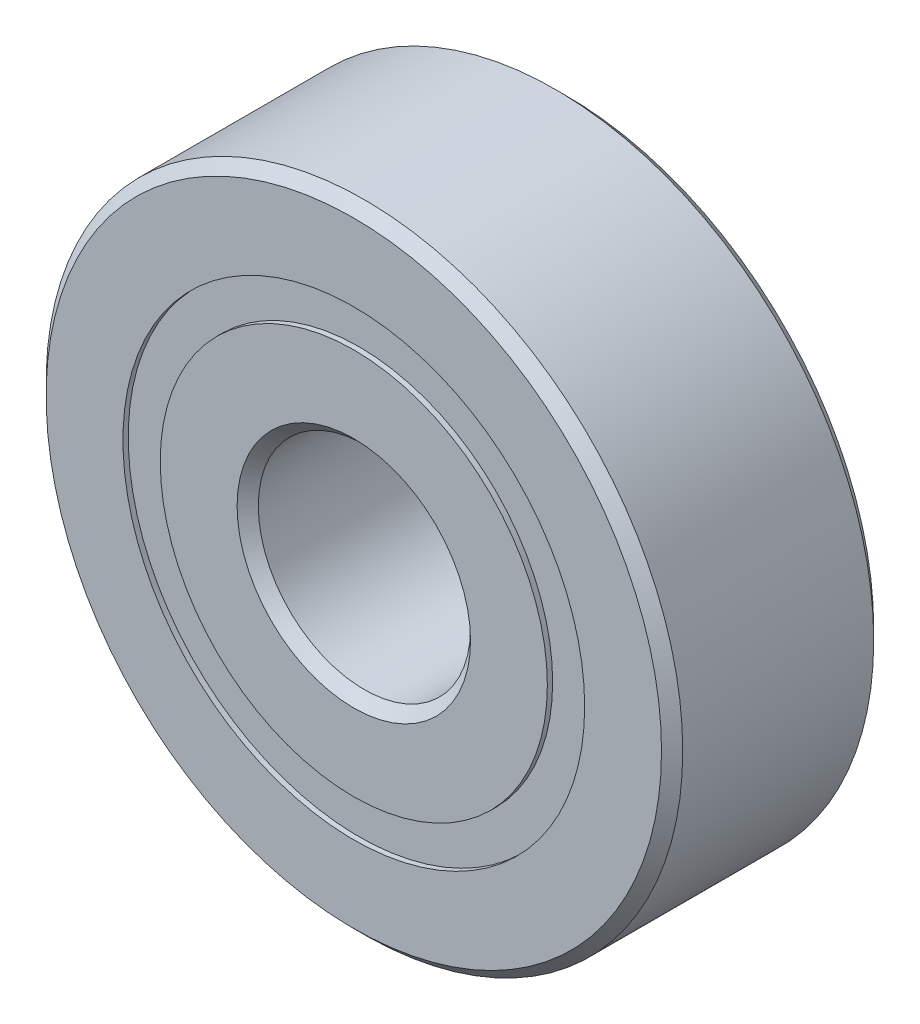
ISO-10303-21;
HEADER;
FILE_DESCRIPTION(('STEP AP214'),'2;1');
FILE_NAME('part.step','',(''),(''),'','','');
FILE_SCHEMA(('AUTOMOTIVE_DESIGN { 1 0 10303 214 1 1 1 1 }'));
ENDSEC;
DATA;
#1=APPLICATION_CONTEXT('core data for automotive mechanical design processes');
#2=APPLICATION_PROTOCOL_DEFINITION('international standard','automotive_design',2000,#1);
#3=PRODUCT_CONTEXT('',#1,'mechanical');
#4=PRODUCT('Part','Part','',(#3));
#5=PRODUCT_RELATED_PRODUCT_CATEGORY('part','',(#4));
#6=PRODUCT_DEFINITION_FORMATION('','',#4);
#7=PRODUCT_DEFINITION_CONTEXT('part definition',#1,'design');
#8=PRODUCT_DEFINITION('design','',#6,#7);
#9=PRODUCT_DEFINITION_SHAPE('','',#8);
#10=(LENGTH_UNIT() NAMED_UNIT(*) SI_UNIT(.MILLI.,.METRE.));
#11=(NAMED_UNIT(*) PLANE_ANGLE_UNIT() SI_UNIT($,.RADIAN.));
#12=(NAMED_UNIT(*) SI_UNIT($,.STERADIAN.) SOLID_ANGLE_UNIT());
#13=UNCERTAINTY_MEASURE_WITH_UNIT(LENGTH_MEASURE(1.E-05),#10,'distance_accuracy_value','');
#14=(GEOMETRIC_REPRESENTATION_CONTEXT(3) GLOBAL_UNCERTAINTY_ASSIGNED_CONTEXT((#13)) GLOBAL_UNIT_ASSIGNED_CONTEXT((#10,
#11,#12)) REPRESENTATION_CONTEXT('',''));
#15=CARTESIAN_POINT('',(0.,0.,0.));
#16=DIRECTION('',(0.,0.,1.));
#17=DIRECTION('',(1.,0.,0.));
#18=AXIS2_PLACEMENT_3D('',#15,#16,#17);
#19=CARTESIAN_POINT('',(0.,4.35164835164835,-1.9));
#20=DIRECTION('',(0.,0.,1.));
#21=DIRECTION('',(1.,0.,0.));
#22=AXIS2_PLACEMENT_3D('',#19,#20,#21);
#23=PLANE('',#22);
#24=CARTESIAN_POINT('',(0.,0.,-1.9));
#25=DIRECTION('',(0.,0.,1.));
#26=DIRECTION('',(1.,0.,0.));
#27=AXIS2_PLACEMENT_3D('',#24,#25,#26);
#28=CIRCLE('',#27,4.35164835164835);
#29=CARTESIAN_POINT('',(4.35164835164835,0.,-1.9));
#30=VERTEX_POINT('',#29);
#31=EDGE_CURVE('E57',#30,#30,#28,.T.);
#32=ORIENTED_EDGE('',*,*,#31,.F.);
#33=EDGE_LOOP('',(#32));
#34=FACE_BOUND('',#33,.T.);
#35=CARTESIAN_POINT('',(0.,0.,-1.9));
#36=DIRECTION('',(0.,0.,1.));
#37=DIRECTION('',(1.,0.,0.));
#38=AXIS2_PLACEMENT_3D('',#35,#36,#37);
#39=CIRCLE('',#38,3.64835164835165);
#40=CARTESIAN_POINT('',(3.64835164835165,0.,-1.9));
#41=VERTEX_POINT('',#40);
#42=EDGE_CURVE('E11',#41,#41,#39,.T.);
#43=ORIENTED_EDGE('',*,*,#42,.T.);
#44=EDGE_LOOP('',(#43));
#45=FACE_BOUND('',#44,.T.);
#46=ADVANCED_FACE('F43',(#34,#45),#23,.F.);
#47=CARTESIAN_POINT('',(0.,0.,2.));
#48=DIRECTION('',(0.,0.,1.));
#49=DIRECTION('',(1.,0.,0.));
#50=AXIS2_PLACEMENT_3D('',#47,#48,#49);
#51=CYLINDRICAL_SURFACE('',#50,3.64835164835165);
#52=ORIENTED_EDGE('',*,*,#42,.F.);
#53=EDGE_LOOP('',(#52));
#54=FACE_BOUND('',#53,.T.);
#55=CARTESIAN_POINT('',(0.,0.,-0.955918417024762));
#56=DIRECTION('',(0.,0.,1.));
#57=DIRECTION('',(1.,0.,0.));
#58=AXIS2_PLACEMENT_3D('',#55,#56,#57);
#59=CIRCLE('',#58,3.64835164835165);
#60=CARTESIAN_POINT('',(3.64835164835165,0.,-0.955918417024762));
#61=VERTEX_POINT('',#60);
#62=EDGE_CURVE('E49',#61,#61,#59,.T.);
#63=ORIENTED_EDGE('',*,*,#62,.T.);
#64=EDGE_LOOP('',(#63));
#65=FACE_BOUND('',#64,.T.);
#66=ADVANCED_FACE('F66',(#54,#65),#51,.F.);
#67=CARTESIAN_POINT('',(0.,4.35164835164835,-0.955918417024762));
#68=DIRECTION('',(0.,0.,-1.));
#69=DIRECTION('',(-1.,0.,0.));
#70=AXIS2_PLACEMENT_3D('',#67,#68,#69);
#71=PLANE('',#70);
#72=ORIENTED_EDGE('',*,*,#62,.F.);
#73=EDGE_LOOP('',(#72));
#74=FACE_BOUND('',#73,.T.);
#75=CARTESIAN_POINT('',(0.,0.,-0.955918417024762));
#76=DIRECTION('',(0.,0.,1.));
#77=DIRECTION('',(1.,0.,0.));
#78=AXIS2_PLACEMENT_3D('',#75,#76,#77);
#79=CIRCLE('',#78,4.35164835164835);
#80=CARTESIAN_POINT('',(4.35164835164835,0.,-0.955918417024762));
#81=VERTEX_POINT('',#80);
#82=EDGE_CURVE('E53',#81,#81,#79,.T.);
#83=ORIENTED_EDGE('',*,*,#82,.T.);
#84=EDGE_LOOP('',(#83));
#85=FACE_BOUND('',#84,.T.);
#86=ADVANCED_FACE('F70',(#74,#85),#71,.F.);
#87=CARTESIAN_POINT('',(0.,0.,2.));
#88=DIRECTION('',(0.,0.,1.));
#89=DIRECTION('',(1.,0.,0.));
#90=AXIS2_PLACEMENT_3D('',#87,#88,#89);
#91=CYLINDRICAL_SURFACE('',#90,4.35164835164835);
#92=ORIENTED_EDGE('',*,*,#82,.F.);
#93=EDGE_LOOP('',(#92));
#94=FACE_BOUND('',#93,.T.);
#95=ORIENTED_EDGE('',*,*,#31,.T.);
#96=EDGE_LOOP('',(#95));
#97=FACE_BOUND('',#96,.T.);
#98=ADVANCED_FACE('F63',(#94,#97),#91,.T.);
#99=CLOSED_SHELL('',(#46,#66,#86,#98));
#100=MANIFOLD_SOLID_BREP('B2',#99);
#101=CARTESIAN_POINT('',(0.,4.35164835164835,1.9));
#102=DIRECTION('',(0.,0.,-1.));
#103=DIRECTION('',(-1.,0.,0.));
#104=AXIS2_PLACEMENT_3D('',#101,#102,#103);
#105=PLANE('',#104);
#106=CARTESIAN_POINT('',(0.,0.,1.9));
#107=DIRECTION('',(0.,0.,1.));
#108=DIRECTION('',(1.,0.,0.));
#109=AXIS2_PLACEMENT_3D('',#106,#107,#108);
#110=CIRCLE('',#109,3.64835164835165);
#111=CARTESIAN_POINT('',(3.64835164835165,0.,1.9));
#112=VERTEX_POINT('',#111);
#113=EDGE_CURVE('E42',#112,#112,#110,.T.);
#114=ORIENTED_EDGE('',*,*,#113,.F.);
#115=EDGE_LOOP('',(#114));
#116=FACE_BOUND('',#115,.T.);
#117=CARTESIAN_POINT('',(0.,0.,1.9));
#118=DIRECTION('',(0.,0.,1.));
#119=DIRECTION('',(1.,0.,0.));
#120=AXIS2_PLACEMENT_3D('',#117,#118,#119);
#121=CIRCLE('',#120,4.35164835164835);
#122=CARTESIAN_POINT('',(4.35164835164835,0.,1.9));
#123=VERTEX_POINT('',#122);
#124=EDGE_CURVE('E124',#123,#123,#121,.T.);
#125=ORIENTED_EDGE('',*,*,#124,.T.);
#126=EDGE_LOOP('',(#125));
#127=FACE_BOUND('',#126,.T.);
#128=ADVANCED_FACE('F110',(#116,#127),#105,.F.);
#129=CARTESIAN_POINT('',(0.,0.,2.));
#130=DIRECTION('',(0.,0.,1.));
#131=DIRECTION('',(1.,0.,0.));
#132=AXIS2_PLACEMENT_3D('',#129,#130,#131);
#133=CYLINDRICAL_SURFACE('',#132,3.64835164835165);
#134=CARTESIAN_POINT('',(0.,0.,0.955918417024761));
#135=DIRECTION('',(0.,0.,1.));
#136=DIRECTION('',(1.,0.,0.));
#137=AXIS2_PLACEMENT_3D('',#134,#135,#136);
#138=CIRCLE('',#137,3.64835164835165);
#139=CARTESIAN_POINT('',(3.64835164835165,0.,0.955918417024761));
#140=VERTEX_POINT('',#139);
#141=EDGE_CURVE('E116',#140,#140,#138,.T.);
#142=ORIENTED_EDGE('',*,*,#141,.F.);
#143=EDGE_LOOP('',(#142));
#144=FACE_BOUND('',#143,.T.);
#145=ORIENTED_EDGE('',*,*,#113,.T.);
#146=EDGE_LOOP('',(#145));
#147=FACE_BOUND('',#146,.T.);
#148=ADVANCED_FACE('F139',(#144,#147),#133,.F.);
#149=CARTESIAN_POINT('',(0.,4.35164835164835,0.955918417024761));
#150=DIRECTION('',(0.,0.,1.));
#151=DIRECTION('',(1.,0.,0.));
#152=AXIS2_PLACEMENT_3D('',#149,#150,#151);
#153=PLANE('',#152);
#154=CARTESIAN_POINT('',(0.,0.,0.955918417024761));
#155=DIRECTION('',(0.,0.,1.));
#156=DIRECTION('',(1.,0.,0.));
#157=AXIS2_PLACEMENT_3D('',#154,#155,#156);
#158=CIRCLE('',#157,4.35164835164835);
#159=CARTESIAN_POINT('',(4.35164835164835,0.,0.955918417024761));
#160=VERTEX_POINT('',#159);
#161=EDGE_CURVE('E120',#160,#160,#158,.T.);
#162=ORIENTED_EDGE('',*,*,#161,.F.);
#163=EDGE_LOOP('',(#162));
#164=FACE_BOUND('',#163,.T.);
#165=ORIENTED_EDGE('',*,*,#141,.T.);
#166=EDGE_LOOP('',(#165));
#167=FACE_BOUND('',#166,.T.);
#168=ADVANCED_FACE('F134',(#164,#167),#153,.F.);
#169=CARTESIAN_POINT('',(0.,0.,2.));
#170=DIRECTION('',(0.,0.,1.));
#171=DIRECTION('',(1.,0.,0.));
#172=AXIS2_PLACEMENT_3D('',#169,#170,#171);
#173=CYLINDRICAL_SURFACE('',#172,4.35164835164835);
#174=ORIENTED_EDGE('',*,*,#124,.F.);
#175=EDGE_LOOP('',(#174));
#176=FACE_BOUND('',#175,.T.);
#177=ORIENTED_EDGE('',*,*,#161,.T.);
#178=EDGE_LOOP('',(#177));
#179=FACE_BOUND('',#178,.T.);
#180=ADVANCED_FACE('F131',(#176,#179),#173,.T.);
#181=CLOSED_SHELL('',(#128,#148,#168,#180));
#182=MANIFOLD_SOLID_BREP('B6',#181);
#183=CARTESIAN_POINT('',(-1.99999999999996,3.46410161513778,0.));
#184=DIRECTION('',(0.,0.,1.));
#185=DIRECTION('',(-0.499999999999989,0.866025403784445,0.));
#186=AXIS2_PLACEMENT_3D('',#183,#184,#185);
#187=SPHERICAL_SURFACE('',#186,0.955918417024761);
#188=CARTESIAN_POINT('',(-1.99999999999996,3.46410161513778,0.955918417024761));
#189=VERTEX_POINT('',#188);
#190=VERTEX_LOOP('',#189);
#191=FACE_BOUND('',#190,.T.);
#192=ADVANCED_FACE('F177',(#191),#187,.T.);
#193=CLOSED_SHELL('',(#192));
#194=MANIFOLD_SOLID_BREP('B37',#193);
#195=CARTESIAN_POINT('',(-3.46410161513773,2.00000000000004,0.));
#196=DIRECTION('',(0.,0.,1.));
#197=DIRECTION('',(-0.866025403784433,0.50000000000001,0.));
#198=AXIS2_PLACEMENT_3D('',#195,#196,#197);
#199=SPHERICAL_SURFACE('',#198,0.955918417024761);
#200=CARTESIAN_POINT('',(-3.46410161513773,2.00000000000004,0.955918417024761));
#201=VERTEX_POINT('',#200);
#202=VERTEX_LOOP('',#201);
#203=FACE_BOUND('',#202,.T.);
#204=ADVANCED_FACE('F198',(#203),#199,.T.);
#205=CLOSED_SHELL('',(#204));
#206=MANIFOLD_SOLID_BREP('B106',#205);
#207=CARTESIAN_POINT('',(-4.,0.,0.));
#208=DIRECTION('',(0.,0.,1.));
#209=DIRECTION('',(-1.,0.,0.));
#210=AXIS2_PLACEMENT_3D('',#207,#208,#209);
#211=SPHERICAL_SURFACE('',#210,0.955918417024761);
#212=CARTESIAN_POINT('',(-4.,0.,0.955918417024761));
#213=VERTEX_POINT('',#212);
#214=VERTEX_LOOP('',#213);
#215=FACE_BOUND('',#214,.T.);
#216=ADVANCED_FACE('F221',(#215),#211,.T.);
#217=CLOSED_SHELL('',(#216));
#218=MANIFOLD_SOLID_BREP('B173',#217);
#219=CARTESIAN_POINT('',(-3.46410161513777,-1.99999999999997,0.));
#220=DIRECTION('',(0.,0.,1.));
#221=DIRECTION('',(-0.866025403784443,-0.499999999999992,0.));
#222=AXIS2_PLACEMENT_3D('',#219,#220,#221);
#223=SPHERICAL_SURFACE('',#222,0.955918417024761);
#224=CARTESIAN_POINT('',(-3.46410161513777,-1.99999999999997,0.955918417024761));
#225=VERTEX_POINT('',#224);
#226=VERTEX_LOOP('',#225);
#227=FACE_BOUND('',#226,.T.);
#228=ADVANCED_FACE('F241',(#227),#223,.T.);
#229=CLOSED_SHELL('',(#228));
#230=MANIFOLD_SOLID_BREP('B194',#229);
#231=CARTESIAN_POINT('',(-2.00000000000003,-3.46410161513774,0.));
#232=DIRECTION('',(0.,0.,1.));
#233=DIRECTION('',(-0.500000000000007,-0.866025403784435,0.));
#234=AXIS2_PLACEMENT_3D('',#231,#232,#233);
#235=SPHERICAL_SURFACE('',#234,0.955918417024761);
#236=CARTESIAN_POINT('',(-2.00000000000003,-3.46410161513774,0.955918417024761));
#237=VERTEX_POINT('',#236);
#238=VERTEX_LOOP('',#237);
#239=FACE_BOUND('',#238,.T.);
#240=ADVANCED_FACE('F261',(#239),#235,.T.);
#241=CLOSED_SHELL('',(#240));
#242=MANIFOLD_SOLID_BREP('B217',#241);
#243=CARTESIAN_POINT('',(0.,-4.,0.));
#244=DIRECTION('',(0.,0.,1.));
#245=DIRECTION('',(0.,-1.,0.));
#246=AXIS2_PLACEMENT_3D('',#243,#244,#245);
#247=SPHERICAL_SURFACE('',#246,0.955918417024761);
#248=CARTESIAN_POINT('',(0.,-4.,0.955918417024761));
#249=VERTEX_POINT('',#248);
#250=VERTEX_LOOP('',#249);
#251=FACE_BOUND('',#250,.T.);
#252=ADVANCED_FACE('F281',(#251),#247,.T.);
#253=CLOSED_SHELL('',(#252));
#254=MANIFOLD_SOLID_BREP('B237',#253);
#255=CARTESIAN_POINT('',(1.99999999999998,-3.46410161513777,0.));
#256=DIRECTION('',(0.,0.,1.));
#257=DIRECTION('',(0.499999999999995,-0.866025403784442,0.));
#258=AXIS2_PLACEMENT_3D('',#255,#256,#257);
#259=SPHERICAL_SURFACE('',#258,0.955918417024761);
#260=CARTESIAN_POINT('',(1.99999999999998,-3.46410161513777,0.955918417024761));
#261=VERTEX_POINT('',#260);
#262=VERTEX_LOOP('',#261);
#263=FACE_BOUND('',#262,.T.);
#264=ADVANCED_FACE('F301',(#263),#259,.T.);
#265=CLOSED_SHELL('',(#264));
#266=MANIFOLD_SOLID_BREP('B257',#265);
#267=CARTESIAN_POINT('',(3.46410161513775,-2.00000000000002,0.));
#268=DIRECTION('',(0.,0.,1.));
#269=DIRECTION('',(0.866025403784436,-0.500000000000004,0.));
#270=AXIS2_PLACEMENT_3D('',#267,#268,#269);
#271=SPHERICAL_SURFACE('',#270,0.955918417024761);
#272=CARTESIAN_POINT('',(3.46410161513775,-2.00000000000002,0.955918417024761));
#273=VERTEX_POINT('',#272);
#274=VERTEX_LOOP('',#273);
#275=FACE_BOUND('',#274,.T.);
#276=ADVANCED_FACE('F321',(#275),#271,.T.);
#277=CLOSED_SHELL('',(#276));
#278=MANIFOLD_SOLID_BREP('B277',#277);
#279=CARTESIAN_POINT('',(4.,0.,0.));
#280=DIRECTION('',(0.,0.,1.));
#281=DIRECTION('',(1.,0.,0.));
#282=AXIS2_PLACEMENT_3D('',#279,#280,#281);
#283=SPHERICAL_SURFACE('',#282,0.955918417024761);
#284=CARTESIAN_POINT('',(4.,0.,0.955918417024761));
#285=VERTEX_POINT('',#284);
#286=VERTEX_LOOP('',#285);
#287=FACE_BOUND('',#286,.T.);
#288=ADVANCED_FACE('F341',(#287),#283,.T.);
#289=CLOSED_SHELL('',(#288));
#290=MANIFOLD_SOLID_BREP('B297',#289);
#291=CARTESIAN_POINT('',(3.46410161513776,1.99999999999999,0.));
#292=DIRECTION('',(0.,0.,1.));
#293=DIRECTION('',(0.86602540378444,0.499999999999998,0.));
#294=AXIS2_PLACEMENT_3D('',#291,#292,#293);
#295=SPHERICAL_SURFACE('',#294,0.955918417024761);
#296=CARTESIAN_POINT('',(3.46410161513776,1.99999999999999,0.955918417024761));
#297=VERTEX_POINT('',#296);
#298=VERTEX_LOOP('',#297);
#299=FACE_BOUND('',#298,.T.);
#300=ADVANCED_FACE('F361',(#299),#295,.T.);
#301=CLOSED_SHELL('',(#300));
#302=MANIFOLD_SOLID_BREP('B317',#301);
#303=CARTESIAN_POINT('',(2.,3.46410161513775,0.));
#304=DIRECTION('',(0.,0.,1.));
#305=DIRECTION('',(0.500000000000001,0.866025403784438,0.));
#306=AXIS2_PLACEMENT_3D('',#303,#304,#305);
#307=SPHERICAL_SURFACE('',#306,0.955918417024761);
#308=CARTESIAN_POINT('',(2.,3.46410161513775,0.955918417024761));
#309=VERTEX_POINT('',#308);
#310=VERTEX_LOOP('',#309);
#311=FACE_BOUND('',#310,.T.);
#312=ADVANCED_FACE('F382',(#311),#307,.T.);
#313=CLOSED_SHELL('',(#312));
#314=MANIFOLD_SOLID_BREP('B337',#313);
#315=CARTESIAN_POINT('',(0.,4.,0.));
#316=DIRECTION('',(0.,0.,1.));
#317=DIRECTION('',(0.,1.,0.));
#318=AXIS2_PLACEMENT_3D('',#315,#316,#317);
#319=SPHERICAL_SURFACE('',#318,0.955918417024761);
#320=CARTESIAN_POINT('',(0.,4.,0.955918417024761));
#321=VERTEX_POINT('',#320);
#322=VERTEX_LOOP('',#321);
#323=FACE_BOUND('',#322,.T.);
#324=ADVANCED_FACE('F408',(#323),#319,.T.);
#325=CLOSED_SHELL('',(#324));
#326=MANIFOLD_SOLID_BREP('B357',#325);
#327=CARTESIAN_POINT('',(0.,3.64835164835165,2.));
#328=DIRECTION('',(0.,0.,-1.));
#329=DIRECTION('',(-1.,0.,0.));
#330=AXIS2_PLACEMENT_3D('',#327,#328,#329);
#331=PLANE('',#330);
#332=CARTESIAN_POINT('',(0.,0.,2.));
#333=DIRECTION('',(0.,0.,1.));
#334=DIRECTION('',(1.,0.,0.));
#335=AXIS2_PLACEMENT_3D('',#332,#333,#334);
#336=CIRCLE('',#335,2.2);
#337=CARTESIAN_POINT('',(2.2,0.,2.));
#338=VERTEX_POINT('',#337);
#339=EDGE_CURVE('E459',#338,#338,#336,.T.);
#340=ORIENTED_EDGE('',*,*,#339,.F.);
#341=EDGE_LOOP('',(#340));
#342=FACE_BOUND('',#341,.T.);
#343=CARTESIAN_POINT('',(0.,0.,2.));
#344=DIRECTION('',(0.,0.,1.));
#345=DIRECTION('',(1.,0.,0.));
#346=AXIS2_PLACEMENT_3D('',#343,#344,#345);
#347=CIRCLE('',#346,3.64835164835165);
#348=CARTESIAN_POINT('',(3.64835164835165,0.,2.));
#349=VERTEX_POINT('',#348);
#350=EDGE_CURVE('E407',#349,#349,#347,.T.);
#351=ORIENTED_EDGE('',*,*,#350,.T.);
#352=EDGE_LOOP('',(#351));
#353=FACE_BOUND('',#352,.T.);
#354=ADVANCED_FACE('F431',(#342,#353),#331,.F.);
#355=CARTESIAN_POINT('',(0.,0.,2.));
#356=DIRECTION('',(0.,0.,1.));
#357=DIRECTION('',(1.,0.,0.));
#358=AXIS2_PLACEMENT_3D('',#355,#356,#357);
#359=CYLINDRICAL_SURFACE('',#358,3.64835164835165);
#360=ORIENTED_EDGE('',*,*,#350,.F.);
#361=EDGE_LOOP('',(#360));
#362=FACE_BOUND('',#361,.T.);
#363=CARTESIAN_POINT('',(0.,0.,0.888888888888889));
#364=DIRECTION('',(0.,0.,1.));
#365=DIRECTION('',(1.,0.,0.));
#366=AXIS2_PLACEMENT_3D('',#363,#364,#365);
#367=CIRCLE('',#366,3.64835164835165);
#368=CARTESIAN_POINT('',(3.64835164835165,0.,0.888888888888889));
#369=VERTEX_POINT('',#368);
#370=EDGE_CURVE('E437',#369,#369,#367,.T.);
#371=ORIENTED_EDGE('',*,*,#370,.T.);
#372=EDGE_LOOP('',(#371));
#373=FACE_BOUND('',#372,.T.);
#374=ADVANCED_FACE('F466',(#362,#373),#359,.T.);
#375=CARTESIAN_POINT('',(0.,0.,0.));
#376=DIRECTION('',(0.,0.,1.));
#377=DIRECTION('',(1.,0.,0.));
#378=AXIS2_PLACEMENT_3D('',#375,#376,#377);
#379=TOROIDAL_SURFACE('',#378,4.,0.95591841702476);
#380=ORIENTED_EDGE('',*,*,#370,.F.);
#381=EDGE_LOOP('',(#380));
#382=FACE_BOUND('',#381,.T.);
#383=CARTESIAN_POINT('',(0.,0.,-0.88888888888889));
#384=DIRECTION('',(0.,0.,1.));
#385=DIRECTION('',(1.,0.,0.));
#386=AXIS2_PLACEMENT_3D('',#383,#384,#385);
#387=CIRCLE('',#386,3.64835164835165);
#388=CARTESIAN_POINT('',(3.64835164835165,0.,-0.88888888888889));
#389=VERTEX_POINT('',#388);
#390=EDGE_CURVE('E441',#389,#389,#387,.T.);
#391=ORIENTED_EDGE('',*,*,#390,.T.);
#392=EDGE_LOOP('',(#391));
#393=FACE_BOUND('',#392,.T.);
#394=ADVANCED_FACE('F470',(#382,#393),#379,.F.);
#395=CARTESIAN_POINT('',(0.,0.,2.));
#396=DIRECTION('',(0.,0.,1.));
#397=DIRECTION('',(1.,0.,0.));
#398=AXIS2_PLACEMENT_3D('',#395,#396,#397);
#399=CYLINDRICAL_SURFACE('',#398,3.64835164835165);
#400=ORIENTED_EDGE('',*,*,#390,.F.);
#401=EDGE_LOOP('',(#400));
#402=FACE_BOUND('',#401,.T.);
#403=CARTESIAN_POINT('',(0.,0.,-2.));
#404=DIRECTION('',(0.,0.,1.));
#405=DIRECTION('',(1.,0.,0.));
#406=AXIS2_PLACEMENT_3D('',#403,#404,#405);
#407=CIRCLE('',#406,3.64835164835165);
#408=CARTESIAN_POINT('',(3.64835164835165,0.,-2.));
#409=VERTEX_POINT('',#408);
#410=EDGE_CURVE('E445',#409,#409,#407,.T.);
#411=ORIENTED_EDGE('',*,*,#410,.T.);
#412=EDGE_LOOP('',(#411));
#413=FACE_BOUND('',#412,.T.);
#414=ADVANCED_FACE('F475',(#402,#413),#399,.T.);
#415=CARTESIAN_POINT('',(0.,2.2,-2.));
#416=DIRECTION('',(0.,0.,1.));
#417=DIRECTION('',(1.,0.,0.));
#418=AXIS2_PLACEMENT_3D('',#415,#416,#417);
#419=PLANE('',#418);
#420=ORIENTED_EDGE('',*,*,#410,.F.);
#421=EDGE_LOOP('',(#420));
#422=FACE_BOUND('',#421,.T.);
#423=CARTESIAN_POINT('',(0.,0.,-2.));
#424=DIRECTION('',(0.,0.,1.));
#425=DIRECTION('',(1.,0.,0.));
#426=AXIS2_PLACEMENT_3D('',#423,#424,#425);
#427=CIRCLE('',#426,2.2);
#428=CARTESIAN_POINT('',(2.2,0.,-2.));
#429=VERTEX_POINT('',#428);
#430=EDGE_CURVE('E450',#429,#429,#427,.T.);
#431=ORIENTED_EDGE('',*,*,#430,.T.);
#432=EDGE_LOOP('',(#431));
#433=FACE_BOUND('',#432,.T.);
#434=ADVANCED_FACE('F481',(#422,#433),#419,.F.);
#435=CARTESIAN_POINT('',(0.,0.,-1.8));
#436=DIRECTION('',(0.,0.,-1.));
#437=DIRECTION('',(-1.,0.,0.));
#438=AXIS2_PLACEMENT_3D('',#435,#436,#437);
#439=CONICAL_SURFACE('',#438,2.,0.785398163397454);
#440=ORIENTED_EDGE('',*,*,#430,.F.);
#441=EDGE_LOOP('',(#440));
#442=FACE_BOUND('',#441,.T.);
#443=CARTESIAN_POINT('',(0.,0.,-1.8));
#444=DIRECTION('',(0.,0.,1.));
#445=DIRECTION('',(1.,0.,0.));
#446=AXIS2_PLACEMENT_3D('',#443,#444,#445);
#447=CIRCLE('',#446,2.);
#448=CARTESIAN_POINT('',(2.,0.,-1.8));
#449=VERTEX_POINT('',#448);
#450=EDGE_CURVE('E453',#449,#449,#447,.T.);
#451=ORIENTED_EDGE('',*,*,#450,.T.);
#452=EDGE_LOOP('',(#451));
#453=FACE_BOUND('',#452,.T.);
#454=ADVANCED_FACE('F485',(#442,#453),#439,.F.);
#455=CARTESIAN_POINT('',(0.,0.,2.));
#456=DIRECTION('',(0.,0.,1.));
#457=DIRECTION('',(1.,0.,0.));
#458=AXIS2_PLACEMENT_3D('',#455,#456,#457);
#459=CYLINDRICAL_SURFACE('',#458,2.);
#460=ORIENTED_EDGE('',*,*,#450,.F.);
#461=EDGE_LOOP('',(#460));
#462=FACE_BOUND('',#461,.T.);
#463=CARTESIAN_POINT('',(0.,0.,1.8));
#464=DIRECTION('',(0.,0.,1.));
#465=DIRECTION('',(1.,0.,0.));
#466=AXIS2_PLACEMENT_3D('',#463,#464,#465);
#467=CIRCLE('',#466,2.);
#468=CARTESIAN_POINT('',(2.,0.,1.8));
#469=VERTEX_POINT('',#468);
#470=EDGE_CURVE('E456',#469,#469,#467,.T.);
#471=ORIENTED_EDGE('',*,*,#470,.T.);
#472=EDGE_LOOP('',(#471));
#473=FACE_BOUND('',#472,.T.);
#474=ADVANCED_FACE('F489',(#462,#473),#459,.F.);
#475=CARTESIAN_POINT('',(0.,0.,2.));
#476=DIRECTION('',(0.,0.,1.));
#477=DIRECTION('',(1.,0.,0.));
#478=AXIS2_PLACEMENT_3D('',#475,#476,#477);
#479=CONICAL_SURFACE('',#478,2.2,0.785398163397442);
#480=ORIENTED_EDGE('',*,*,#470,.F.);
#481=EDGE_LOOP('',(#480));
#482=FACE_BOUND('',#481,.T.);
#483=ORIENTED_EDGE('',*,*,#339,.T.);
#484=EDGE_LOOP('',(#483));
#485=FACE_BOUND('',#484,.T.);
#486=ADVANCED_FACE('F463',(#482,#485),#479,.F.);
#487=CLOSED_SHELL('',(#354,#374,#394,#414,#434,#454,#474,#486));
#488=MANIFOLD_SOLID_BREP('B378',#487);
#489=CARTESIAN_POINT('',(0.,0.,1.8));
#490=DIRECTION('',(0.,0.,-1.));
#491=DIRECTION('',(-1.,0.,0.));
#492=AXIS2_PLACEMENT_3D('',#489,#490,#491);
#493=CONICAL_SURFACE('',#492,6.,0.78539816339745);
#494=CARTESIAN_POINT('',(0.,0.,2.));
#495=DIRECTION('',(0.,0.,1.));
#496=DIRECTION('',(1.,0.,0.));
#497=AXIS2_PLACEMENT_3D('',#494,#495,#496);
#498=CIRCLE('',#497,5.8);
#499=CARTESIAN_POINT('',(5.8,0.,2.));
#500=VERTEX_POINT('',#499);
#501=EDGE_CURVE('E583',#500,#500,#498,.T.);
#502=ORIENTED_EDGE('',*,*,#501,.F.);
#503=EDGE_LOOP('',(#502));
#504=FACE_BOUND('',#503,.T.);
#505=CARTESIAN_POINT('',(0.,0.,1.8));
#506=DIRECTION('',(0.,0.,1.));
#507=DIRECTION('',(1.,0.,0.));
#508=AXIS2_PLACEMENT_3D('',#505,#506,#507);
#509=CIRCLE('',#508,6.);
#510=CARTESIAN_POINT('',(6.,0.,1.8));
#511=VERTEX_POINT('',#510);
#512=EDGE_CURVE('E430',#511,#511,#509,.T.);
#513=ORIENTED_EDGE('',*,*,#512,.T.);
#514=EDGE_LOOP('',(#513));
#515=FACE_BOUND('',#514,.T.);
#516=ADVANCED_FACE('F555',(#504,#515),#493,.T.);
#517=CARTESIAN_POINT('',(0.,0.,2.));
#518=DIRECTION('',(0.,0.,1.));
#519=DIRECTION('',(1.,0.,0.));
#520=AXIS2_PLACEMENT_3D('',#517,#518,#519);
#521=CYLINDRICAL_SURFACE('',#520,6.);
#522=ORIENTED_EDGE('',*,*,#512,.F.);
#523=EDGE_LOOP('',(#522));
#524=FACE_BOUND('',#523,.T.);
#525=CARTESIAN_POINT('',(0.,0.,-1.8));
#526=DIRECTION('',(0.,0.,1.));
#527=DIRECTION('',(1.,0.,0.));
#528=AXIS2_PLACEMENT_3D('',#525,#526,#527);
#529=CIRCLE('',#528,6.);
#530=CARTESIAN_POINT('',(6.,0.,-1.8));
#531=VERTEX_POINT('',#530);
#532=EDGE_CURVE('E561',#531,#531,#529,.T.);
#533=ORIENTED_EDGE('',*,*,#532,.T.);
#534=EDGE_LOOP('',(#533));
#535=FACE_BOUND('',#534,.T.);
#536=ADVANCED_FACE('F590',(#524,#535),#521,.T.);
#537=CARTESIAN_POINT('',(0.,0.,-2.));
#538=DIRECTION('',(0.,0.,1.));
#539=DIRECTION('',(1.,0.,0.));
#540=AXIS2_PLACEMENT_3D('',#537,#538,#539);
#541=CONICAL_SURFACE('',#540,5.8,0.78539816339745);
#542=ORIENTED_EDGE('',*,*,#532,.F.);
#543=EDGE_LOOP('',(#542));
#544=FACE_BOUND('',#543,.T.);
#545=CARTESIAN_POINT('',(0.,0.,-2.));
#546=DIRECTION('',(0.,0.,1.));
#547=DIRECTION('',(1.,0.,0.));
#548=AXIS2_PLACEMENT_3D('',#545,#546,#547);
#549=CIRCLE('',#548,5.8);
#550=CARTESIAN_POINT('',(5.8,0.,-2.));
#551=VERTEX_POINT('',#550);
#552=EDGE_CURVE('E565',#551,#551,#549,.T.);
#553=ORIENTED_EDGE('',*,*,#552,.T.);
#554=EDGE_LOOP('',(#553));
#555=FACE_BOUND('',#554,.T.);
#556=ADVANCED_FACE('F594',(#544,#555),#541,.T.);
#557=CARTESIAN_POINT('',(0.,5.8,-2.));
#558=DIRECTION('',(0.,0.,1.));
#559=DIRECTION('',(1.,0.,0.));
#560=AXIS2_PLACEMENT_3D('',#557,#558,#559);
#561=PLANE('',#560);
#562=ORIENTED_EDGE('',*,*,#552,.F.);
#563=EDGE_LOOP('',(#562));
#564=FACE_BOUND('',#563,.T.);
#565=CARTESIAN_POINT('',(0.,0.,-2.));
#566=DIRECTION('',(0.,0.,1.));
#567=DIRECTION('',(1.,0.,0.));
#568=AXIS2_PLACEMENT_3D('',#565,#566,#567);
#569=CIRCLE('',#568,4.35164835164835);
#570=CARTESIAN_POINT('',(4.35164835164835,0.,-2.));
#571=VERTEX_POINT('',#570);
#572=EDGE_CURVE('E569',#571,#571,#569,.T.);
#573=ORIENTED_EDGE('',*,*,#572,.T.);
#574=EDGE_LOOP('',(#573));
#575=FACE_BOUND('',#574,.T.);
#576=ADVANCED_FACE('F599',(#564,#575),#561,.F.);
#577=CARTESIAN_POINT('',(0.,0.,2.));
#578=DIRECTION('',(0.,0.,1.));
#579=DIRECTION('',(1.,0.,0.));
#580=AXIS2_PLACEMENT_3D('',#577,#578,#579);
#581=CYLINDRICAL_SURFACE('',#580,4.35164835164835);
#582=ORIENTED_EDGE('',*,*,#572,.F.);
#583=EDGE_LOOP('',(#582));
#584=FACE_BOUND('',#583,.T.);
#585=CARTESIAN_POINT('',(0.,0.,-0.888888888888889));
#586=DIRECTION('',(0.,0.,1.));
#587=DIRECTION('',(1.,0.,0.));
#588=AXIS2_PLACEMENT_3D('',#585,#586,#587);
#589=CIRCLE('',#588,4.35164835164835);
#590=CARTESIAN_POINT('',(4.35164835164835,0.,-0.888888888888889));
#591=VERTEX_POINT('',#590);
#592=EDGE_CURVE('E574',#591,#591,#589,.T.);
#593=ORIENTED_EDGE('',*,*,#592,.T.);
#594=EDGE_LOOP('',(#593));
#595=FACE_BOUND('',#594,.T.);
#596=ADVANCED_FACE('F605',(#584,#595),#581,.F.);
#597=CARTESIAN_POINT('',(0.,0.,0.));
#598=DIRECTION('',(0.,0.,1.));
#599=DIRECTION('',(1.,0.,0.));
#600=AXIS2_PLACEMENT_3D('',#597,#598,#599);
#601=TOROIDAL_SURFACE('',#600,4.,0.955918417024761);
#602=ORIENTED_EDGE('',*,*,#592,.F.);
#603=EDGE_LOOP('',(#602));
#604=FACE_BOUND('',#603,.T.);
#605=CARTESIAN_POINT('',(0.,0.,0.888888888888889));
#606=DIRECTION('',(0.,0.,1.));
#607=DIRECTION('',(1.,0.,0.));
#608=AXIS2_PLACEMENT_3D('',#605,#606,#607);
#609=CIRCLE('',#608,4.35164835164835);
#610=CARTESIAN_POINT('',(4.35164835164835,0.,0.888888888888889));
#611=VERTEX_POINT('',#610);
#612=EDGE_CURVE('E577',#611,#611,#609,.T.);
#613=ORIENTED_EDGE('',*,*,#612,.T.);
#614=EDGE_LOOP('',(#613));
#615=FACE_BOUND('',#614,.T.);
#616=ADVANCED_FACE('F609',(#604,#615),#601,.F.);
#617=CARTESIAN_POINT('',(0.,0.,2.));
#618=DIRECTION('',(0.,0.,1.));
#619=DIRECTION('',(1.,0.,0.));
#620=AXIS2_PLACEMENT_3D('',#617,#618,#619);
#621=CYLINDRICAL_SURFACE('',#620,4.35164835164835);
#622=ORIENTED_EDGE('',*,*,#612,.F.);
#623=EDGE_LOOP('',(#622));
#624=FACE_BOUND('',#623,.T.);
#625=CARTESIAN_POINT('',(0.,0.,2.));
#626=DIRECTION('',(0.,0.,1.));
#627=DIRECTION('',(1.,0.,0.));
#628=AXIS2_PLACEMENT_3D('',#625,#626,#627);
#629=CIRCLE('',#628,4.35164835164835);
#630=CARTESIAN_POINT('',(4.35164835164835,0.,2.));
#631=VERTEX_POINT('',#630);
#632=EDGE_CURVE('E580',#631,#631,#629,.T.);
#633=ORIENTED_EDGE('',*,*,#632,.T.);
#634=EDGE_LOOP('',(#633));
#635=FACE_BOUND('',#634,.T.);
#636=ADVANCED_FACE('F613',(#624,#635),#621,.F.);
#637=CARTESIAN_POINT('',(0.,5.8,2.));
#638=DIRECTION('',(0.,0.,-1.));
#639=DIRECTION('',(-1.,0.,0.));
#640=AXIS2_PLACEMENT_3D('',#637,#638,#639);
#641=PLANE('',#640);
#642=ORIENTED_EDGE('',*,*,#632,.F.);
#643=EDGE_LOOP('',(#642));
#644=FACE_BOUND('',#643,.T.);
#645=ORIENTED_EDGE('',*,*,#501,.T.);
#646=EDGE_LOOP('',(#645));
#647=FACE_BOUND('',#646,.T.);
#648=ADVANCED_FACE('F587',(#644,#647),#641,.F.);
#649=CLOSED_SHELL('',(#516,#536,#556,#576,#596,#616,#636,#648));
#650=MANIFOLD_SOLID_BREP('B402',#649);
#651=ADVANCED_BREP_SHAPE_REPRESENTATION('',(#18,#100,#182,#194,#206,#218,#230,#242,#254,#266,
#278,#290,#302,#314,#326,#488,#650),#14);
#652=SHAPE_DEFINITION_REPRESENTATION(#9,#651);
ENDSEC;
END-ISO-10303-21;
